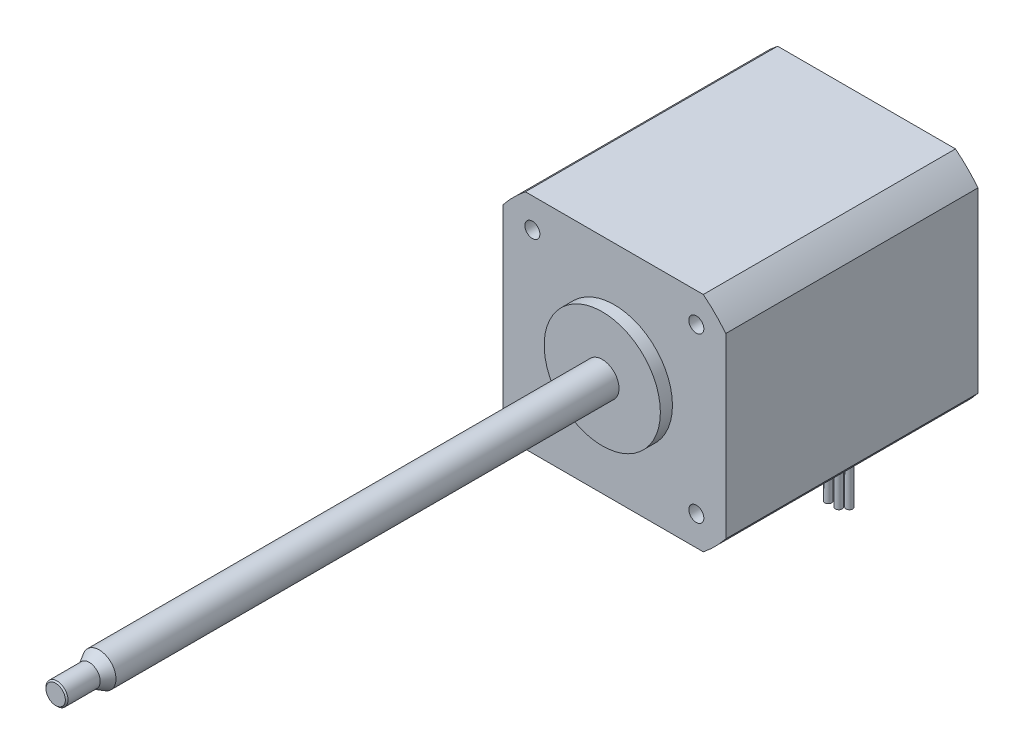
ISO-10303-21;
HEADER;
FILE_DESCRIPTION(('STEP AP214'),'2;1');
FILE_NAME('part.step','',(''),(''),'','','');
FILE_SCHEMA(('AUTOMOTIVE_DESIGN { 1 0 10303 214 1 1 1 1 }'));
ENDSEC;
DATA;
#1=APPLICATION_CONTEXT('core data for automotive mechanical design processes');
#2=APPLICATION_PROTOCOL_DEFINITION('international standard','automotive_design',2000,#1);
#3=PRODUCT_CONTEXT('',#1,'mechanical');
#4=PRODUCT('Part','Part','',(#3));
#5=PRODUCT_RELATED_PRODUCT_CATEGORY('part','',(#4));
#6=PRODUCT_DEFINITION_FORMATION('','',#4);
#7=PRODUCT_DEFINITION_CONTEXT('part definition',#1,'design');
#8=PRODUCT_DEFINITION('design','',#6,#7);
#9=PRODUCT_DEFINITION_SHAPE('','',#8);
#10=(LENGTH_UNIT() NAMED_UNIT(*) SI_UNIT(.MILLI.,.METRE.));
#11=(NAMED_UNIT(*) PLANE_ANGLE_UNIT() SI_UNIT($,.RADIAN.));
#12=(NAMED_UNIT(*) SI_UNIT($,.STERADIAN.) SOLID_ANGLE_UNIT());
#13=UNCERTAINTY_MEASURE_WITH_UNIT(LENGTH_MEASURE(1.E-05),#10,'distance_accuracy_value','');
#14=(GEOMETRIC_REPRESENTATION_CONTEXT(3) GLOBAL_UNCERTAINTY_ASSIGNED_CONTEXT((#13)) GLOBAL_UNIT_ASSIGNED_CONTEXT((#10,
#11,#12)) REPRESENTATION_CONTEXT('',''));
#15=CARTESIAN_POINT('',(0.,0.,0.));
#16=DIRECTION('',(0.,0.,1.));
#17=DIRECTION('',(1.,0.,0.));
#18=AXIS2_PLACEMENT_3D('',#15,#16,#17);
#19=CARTESIAN_POINT('',(0.,0.,105.524017134292));
#20=DIRECTION('',(0.,0.,-1.));
#21=DIRECTION('',(-0.896276816765099,0.443495059419404,0.));
#22=AXIS2_PLACEMENT_3D('',#19,#20,#21);
#23=CONICAL_SURFACE('',#22,2.0828,0.785398163397428);
#24=CARTESIAN_POINT('',(0.,0.,105.774017134292));
#25=DIRECTION('',(0.,0.,-1.));
#26=DIRECTION('',(-0.896276816765099,0.443495059419404,0.));
#27=AXIS2_PLACEMENT_3D('',#24,#25,#26);
#28=CIRCLE('',#27,1.8328);
#29=CARTESIAN_POINT('',(-1.64269614976707,0.812837744903882,105.774017134292));
#30=VERTEX_POINT('',#29);
#31=EDGE_CURVE('E300',#30,#30,#28,.T.);
#32=ORIENTED_EDGE('',*,*,#31,.T.);
#33=EDGE_LOOP('',(#32));
#34=FACE_BOUND('',#33,.T.);
#35=CARTESIAN_POINT('',(0.,0.,105.524017134292));
#36=DIRECTION('',(0.,0.,-1.));
#37=DIRECTION('',(-0.896276816765099,0.443495059419404,0.));
#38=AXIS2_PLACEMENT_3D('',#35,#36,#37);
#39=CIRCLE('',#38,2.0828);
#40=CARTESIAN_POINT('',(-1.86676535395835,0.923711509758735,105.524017134292));
#41=VERTEX_POINT('',#40);
#42=EDGE_CURVE('E25',#41,#41,#39,.T.);
#43=ORIENTED_EDGE('',*,*,#42,.F.);
#44=EDGE_LOOP('',(#43));
#45=FACE_BOUND('',#44,.T.);
#46=ADVANCED_FACE('F16',(#34,#45),#23,.T.);
#47=CARTESIAN_POINT('',(0.,0.,105.774017134292));
#48=DIRECTION('',(0.,0.,-1.));
#49=DIRECTION('',(-0.896276816765099,0.443495059419404,0.));
#50=AXIS2_PLACEMENT_3D('',#47,#48,#49);
#51=CYLINDRICAL_SURFACE('',#50,2.0828);
#52=ORIENTED_EDGE('',*,*,#42,.T.);
#53=EDGE_LOOP('',(#52));
#54=FACE_BOUND('',#53,.T.);
#55=CARTESIAN_POINT('',(0.,0.,99.4240171342925));
#56=DIRECTION('',(0.,0.,-1.));
#57=DIRECTION('',(-0.896276816765099,0.443495059419404,0.));
#58=AXIS2_PLACEMENT_3D('',#55,#56,#57);
#59=CIRCLE('',#58,2.0828);
#60=CARTESIAN_POINT('',(-1.86676535395835,0.923711509758736,99.4240171342925));
#61=VERTEX_POINT('',#60);
#62=EDGE_CURVE('E316',#61,#61,#59,.T.);
#63=ORIENTED_EDGE('',*,*,#62,.F.);
#64=EDGE_LOOP('',(#63));
#65=FACE_BOUND('',#64,.T.);
#66=ADVANCED_FACE('F326',(#54,#65),#51,.T.);
#67=CARTESIAN_POINT('',(0.,0.,97.5322712422657));
#68=DIRECTION('',(0.,0.,-1.));
#69=DIRECTION('',(-0.896276816765099,0.443495059419404,0.));
#70=AXIS2_PLACEMENT_3D('',#67,#68,#69);
#71=CONICAL_SURFACE('',#70,3.175,0.523598775598295);
#72=ORIENTED_EDGE('',*,*,#62,.T.);
#73=EDGE_LOOP('',(#72));
#74=FACE_BOUND('',#73,.T.);
#75=CARTESIAN_POINT('',(0.,0.,97.5322712422657));
#76=DIRECTION('',(0.,0.,-1.));
#77=DIRECTION('',(-0.896276816765099,0.443495059419404,0.));
#78=AXIS2_PLACEMENT_3D('',#75,#76,#77);
#79=CIRCLE('',#78,3.175);
#80=CARTESIAN_POINT('',(-2.84567889322919,1.40809681365661,97.5322712422657));
#81=VERTEX_POINT('',#80);
#82=EDGE_CURVE('E312',#81,#81,#79,.T.);
#83=ORIENTED_EDGE('',*,*,#82,.F.);
#84=EDGE_LOOP('',(#83));
#85=FACE_BOUND('',#84,.T.);
#86=ADVANCED_FACE('F334',(#74,#85),#71,.T.);
#87=CARTESIAN_POINT('',(0.,0.,105.774017134292));
#88=DIRECTION('',(0.,0.,-1.));
#89=DIRECTION('',(-0.896276816765099,0.443495059419404,0.));
#90=AXIS2_PLACEMENT_3D('',#87,#88,#89);
#91=CYLINDRICAL_SURFACE('',#90,3.17500000000001);
#92=CARTESIAN_POINT('',(0.,0.,2.286));
#93=DIRECTION('',(0.,0.,1.));
#94=DIRECTION('',(1.,0.,0.));
#95=AXIS2_PLACEMENT_3D('',#92,#93,#94);
#96=CIRCLE('',#95,3.17500000000001);
#97=CARTESIAN_POINT('',(3.175,0.,2.286));
#98=VERTEX_POINT('',#97);
#99=EDGE_CURVE('E11',#98,#98,#96,.F.);
#100=ORIENTED_EDGE('',*,*,#99,.F.);
#101=EDGE_LOOP('',(#100));
#102=FACE_BOUND('',#101,.T.);
#103=ORIENTED_EDGE('',*,*,#82,.T.);
#104=EDGE_LOOP('',(#103));
#105=FACE_BOUND('',#104,.T.);
#106=ADVANCED_FACE('F339',(#102,#105),#91,.T.);
#107=CARTESIAN_POINT('',(1.64269614976707,-0.812837744903882,105.774017134292));
#108=DIRECTION('',(0.,0.,1.));
#109=DIRECTION('',(0.896276816765099,-0.443495059419404,0.));
#110=AXIS2_PLACEMENT_3D('',#107,#108,#109);
#111=PLANE('',#110);
#112=ORIENTED_EDGE('',*,*,#31,.F.);
#113=EDGE_LOOP('',(#112));
#114=FACE_BOUND('',#113,.T.);
#115=ADVANCED_FACE('F337',(#114),#111,.T.);
#116=CARTESIAN_POINT('',(-2.25,-17.925,-40.75));
#117=DIRECTION('',(0.,1.,0.));
#118=DIRECTION('',(0.,0.,1.));
#119=AXIS2_PLACEMENT_3D('',#116,#117,#118);
#120=PLANE('',#119);
#121=DIRECTION('',(0.,0.,-1.));
#122=VECTOR('',#121,1.);
#123=CARTESIAN_POINT('',(-2.25,-17.925,-44.25));
#124=LINE('',#123,#122);
#125=CARTESIAN_POINT('',(-2.25,-17.925,-40.75));
#126=VERTEX_POINT('',#125);
#127=CARTESIAN_POINT('',(-2.25,-17.925,-44.25));
#128=VERTEX_POINT('',#127);
#129=EDGE_CURVE('E136',#126,#128,#124,.T.);
#130=ORIENTED_EDGE('',*,*,#129,.T.);
#131=DIRECTION('',(1.,0.,0.));
#132=VECTOR('',#131,1.);
#133=CARTESIAN_POINT('',(-2.25,-17.925,-44.25));
#134=LINE('',#133,#132);
#135=CARTESIAN_POINT('',(2.25,-17.925,-44.25));
#136=VERTEX_POINT('',#135);
#137=EDGE_CURVE('E146',#128,#136,#134,.T.);
#138=ORIENTED_EDGE('',*,*,#137,.T.);
#139=DIRECTION('',(0.,0.,1.));
#140=VECTOR('',#139,1.);
#141=CARTESIAN_POINT('',(2.25,-17.925,-44.25));
#142=LINE('',#141,#140);
#143=CARTESIAN_POINT('',(2.25,-17.925,-40.75));
#144=VERTEX_POINT('',#143);
#145=EDGE_CURVE('E152',#136,#144,#142,.T.);
#146=ORIENTED_EDGE('',*,*,#145,.T.);
#147=DIRECTION('',(-1.,0.,0.));
#148=VECTOR('',#147,1.);
#149=CARTESIAN_POINT('',(-2.25,-17.925,-40.75));
#150=LINE('',#149,#148);
#151=EDGE_CURVE('E143',#144,#126,#150,.T.);
#152=ORIENTED_EDGE('',*,*,#151,.T.);
#153=EDGE_LOOP('',(#130,#138,#146,#152));
#154=FACE_BOUND('',#153,.T.);
#155=CARTESIAN_POINT('',(-1.5,-17.925,-42.));
#156=DIRECTION('',(0.,1.,0.));
#157=DIRECTION('',(0.,0.,1.));
#158=AXIS2_PLACEMENT_3D('',#155,#156,#157);
#159=CIRCLE('',#158,0.634999999999999);
#160=CARTESIAN_POINT('',(-1.5,-17.925,-41.365));
#161=VERTEX_POINT('',#160);
#162=EDGE_CURVE('E284',#161,#161,#159,.F.);
#163=ORIENTED_EDGE('',*,*,#162,.F.);
#164=EDGE_LOOP('',(#163));
#165=FACE_BOUND('',#164,.T.);
#166=CARTESIAN_POINT('',(0.500000000000003,-17.925,-42.));
#167=DIRECTION('',(0.,1.,0.));
#168=DIRECTION('',(0.,0.,1.));
#169=AXIS2_PLACEMENT_3D('',#166,#167,#168);
#170=CIRCLE('',#169,0.634999999999999);
#171=CARTESIAN_POINT('',(0.500000000000003,-17.925,-41.365));
#172=VERTEX_POINT('',#171);
#173=EDGE_CURVE('E288',#172,#172,#170,.F.);
#174=ORIENTED_EDGE('',*,*,#173,.F.);
#175=EDGE_LOOP('',(#174));
#176=FACE_BOUND('',#175,.T.);
#177=CARTESIAN_POINT('',(-0.499999999999996,-17.925,-43.));
#178=DIRECTION('',(0.,1.,0.));
#179=DIRECTION('',(0.,0.,1.));
#180=AXIS2_PLACEMENT_3D('',#177,#178,#179);
#181=CIRCLE('',#180,0.634999999999998);
#182=CARTESIAN_POINT('',(-0.499999999999996,-17.925,-42.365));
#183=VERTEX_POINT('',#182);
#184=EDGE_CURVE('E292',#183,#183,#181,.F.);
#185=ORIENTED_EDGE('',*,*,#184,.F.);
#186=EDGE_LOOP('',(#185));
#187=FACE_BOUND('',#186,.T.);
#188=CARTESIAN_POINT('',(1.5,-17.925,-43.));
#189=DIRECTION('',(0.,1.,0.));
#190=DIRECTION('',(0.,0.,1.));
#191=AXIS2_PLACEMENT_3D('',#188,#189,#190);
#192=CIRCLE('',#191,0.634999999999998);
#193=CARTESIAN_POINT('',(1.5,-17.925,-42.365));
#194=VERTEX_POINT('',#193);
#195=EDGE_CURVE('E296',#194,#194,#192,.F.);
#196=ORIENTED_EDGE('',*,*,#195,.F.);
#197=EDGE_LOOP('',(#196));
#198=FACE_BOUND('',#197,.T.);
#199=ADVANCED_FACE('F154',(#154,#165,#176,#187,#198),#120,.F.);
#200=CARTESIAN_POINT('',(-21.1,-21.1,0.));
#201=DIRECTION('',(0.,0.,1.));
#202=DIRECTION('',(1.,0.,0.));
#203=AXIS2_PLACEMENT_3D('',#200,#201,#202);
#204=PLANE('',#203);
#205=CARTESIAN_POINT('',(-15.52,-15.52,0.));
#206=DIRECTION('',(0.,0.,1.));
#207=DIRECTION('',(1.,0.,0.));
#208=AXIS2_PLACEMENT_3D('',#205,#206,#207);
#209=CIRCLE('',#208,1.4224);
#210=CARTESIAN_POINT('',(-14.0976,-15.52,0.));
#211=VERTEX_POINT('',#210);
#212=EDGE_CURVE('E964',#211,#211,#209,.T.);
#213=ORIENTED_EDGE('',*,*,#212,.F.);
#214=EDGE_LOOP('',(#213));
#215=FACE_BOUND('',#214,.T.);
#216=CARTESIAN_POINT('',(15.52,-15.52,0.));
#217=DIRECTION('',(0.,0.,1.));
#218=DIRECTION('',(1.,0.,0.));
#219=AXIS2_PLACEMENT_3D('',#216,#217,#218);
#220=CIRCLE('',#219,1.4224);
#221=CARTESIAN_POINT('',(16.9424,-15.52,0.));
#222=VERTEX_POINT('',#221);
#223=EDGE_CURVE('E824',#222,#222,#220,.T.);
#224=ORIENTED_EDGE('',*,*,#223,.F.);
#225=EDGE_LOOP('',(#224));
#226=FACE_BOUND('',#225,.T.);
#227=CARTESIAN_POINT('',(15.52,15.52,0.));
#228=DIRECTION('',(0.,0.,1.));
#229=DIRECTION('',(1.,0.,0.));
#230=AXIS2_PLACEMENT_3D('',#227,#228,#229);
#231=CIRCLE('',#230,1.4224);
#232=CARTESIAN_POINT('',(16.9424,15.52,0.));
#233=VERTEX_POINT('',#232);
#234=EDGE_CURVE('E767',#233,#233,#231,.T.);
#235=ORIENTED_EDGE('',*,*,#234,.F.);
#236=EDGE_LOOP('',(#235));
#237=FACE_BOUND('',#236,.T.);
#238=CARTESIAN_POINT('',(-15.52,15.52,0.));
#239=DIRECTION('',(0.,0.,1.));
#240=DIRECTION('',(1.,0.,0.));
#241=AXIS2_PLACEMENT_3D('',#238,#239,#240);
#242=CIRCLE('',#241,1.4224);
#243=CARTESIAN_POINT('',(-14.0976,15.52,0.));
#244=VERTEX_POINT('',#243);
#245=EDGE_CURVE('E756',#244,#244,#242,.T.);
#246=ORIENTED_EDGE('',*,*,#245,.F.);
#247=EDGE_LOOP('',(#246));
#248=FACE_BOUND('',#247,.T.);
#249=CARTESIAN_POINT('',(-0.113980167868195,-0.113980167868181,0.));
#250=DIRECTION('',(0.,0.,-1.));
#251=DIRECTION('',(-1.,0.,0.));
#252=AXIS2_PLACEMENT_3D('',#249,#250,#251);
#253=CIRCLE('',#252,26.8351);
#254=CARTESIAN_POINT('',(-16.8385,-21.1,0.));
#255=VERTEX_POINT('',#254);
#256=CARTESIAN_POINT('',(-21.1,-16.8385,0.));
#257=VERTEX_POINT('',#256);
#258=EDGE_CURVE('E199',#255,#257,#253,.T.);
#259=ORIENTED_EDGE('',*,*,#258,.F.);
#260=DIRECTION('',(1.,0.,0.));
#261=VECTOR('',#260,1.);
#262=CARTESIAN_POINT('',(-21.1,-21.1,0.));
#263=LINE('',#262,#261);
#264=CARTESIAN_POINT('',(16.8385,-21.1,0.));
#265=VERTEX_POINT('',#264);
#266=EDGE_CURVE('E260',#255,#265,#263,.T.);
#267=ORIENTED_EDGE('',*,*,#266,.T.);
#268=CARTESIAN_POINT('',(0.113980167868195,-0.113980167868181,0.));
#269=DIRECTION('',(0.,0.,-1.));
#270=DIRECTION('',(1.,0.,0.));
#271=AXIS2_PLACEMENT_3D('',#268,#269,#270);
#272=CIRCLE('',#271,26.8351);
#273=CARTESIAN_POINT('',(21.1,-16.8385,0.));
#274=VERTEX_POINT('',#273);
#275=EDGE_CURVE('E209',#274,#265,#272,.T.);
#276=ORIENTED_EDGE('',*,*,#275,.F.);
#277=DIRECTION('',(0.,1.,0.));
#278=VECTOR('',#277,1.);
#279=CARTESIAN_POINT('',(21.1,21.1,0.));
#280=LINE('',#279,#278);
#281=CARTESIAN_POINT('',(21.1,16.8385,0.));
#282=VERTEX_POINT('',#281);
#283=EDGE_CURVE('E263',#274,#282,#280,.T.);
#284=ORIENTED_EDGE('',*,*,#283,.T.);
#285=CARTESIAN_POINT('',(0.113980167868195,0.113980167868181,0.));
#286=DIRECTION('',(0.,0.,-1.));
#287=DIRECTION('',(-1.,0.,0.));
#288=AXIS2_PLACEMENT_3D('',#285,#286,#287);
#289=CIRCLE('',#288,26.8351);
#290=CARTESIAN_POINT('',(16.8385,21.1,0.));
#291=VERTEX_POINT('',#290);
#292=EDGE_CURVE('E238',#291,#282,#289,.T.);
#293=ORIENTED_EDGE('',*,*,#292,.F.);
#294=DIRECTION('',(-1.,0.,0.));
#295=VECTOR('',#294,1.);
#296=CARTESIAN_POINT('',(-21.1,21.1,0.));
#297=LINE('',#296,#295);
#298=CARTESIAN_POINT('',(-16.8385,21.1,0.));
#299=VERTEX_POINT('',#298);
#300=EDGE_CURVE('E266',#291,#299,#297,.T.);
#301=ORIENTED_EDGE('',*,*,#300,.T.);
#302=CARTESIAN_POINT('',(-0.113980167868195,0.113980167868181,0.));
#303=DIRECTION('',(0.,0.,-1.));
#304=DIRECTION('',(1.,0.,0.));
#305=AXIS2_PLACEMENT_3D('',#302,#303,#304);
#306=CIRCLE('',#305,26.8351);
#307=CARTESIAN_POINT('',(-21.1,16.8385,0.));
#308=VERTEX_POINT('',#307);
#309=EDGE_CURVE('E224',#308,#299,#306,.T.);
#310=ORIENTED_EDGE('',*,*,#309,.F.);
#311=DIRECTION('',(0.,-1.,0.));
#312=VECTOR('',#311,1.);
#313=CARTESIAN_POINT('',(-21.1,21.1,0.));
#314=LINE('',#313,#312);
#315=EDGE_CURVE('E254',#308,#257,#314,.T.);
#316=ORIENTED_EDGE('',*,*,#315,.T.);
#317=EDGE_LOOP('',(#259,#267,#276,#284,#293,#301,#310,#316));
#318=FACE_BOUND('',#317,.T.);
#319=CARTESIAN_POINT('',(0.,0.,0.));
#320=DIRECTION('',(0.,0.,1.));
#321=DIRECTION('',(1.,0.,0.));
#322=AXIS2_PLACEMENT_3D('',#319,#320,#321);
#323=CIRCLE('',#322,10.9982);
#324=CARTESIAN_POINT('',(10.9982,0.,0.));
#325=VERTEX_POINT('',#324);
#326=EDGE_CURVE('E186',#325,#325,#323,.T.);
#327=ORIENTED_EDGE('',*,*,#326,.F.);
#328=EDGE_LOOP('',(#327));
#329=FACE_BOUND('',#328,.T.);
#330=ADVANCED_FACE('F344',(#215,#226,#237,#248,#318,#329),#204,.T.);
#331=CARTESIAN_POINT('',(-21.1,21.1,-47.75));
#332=DIRECTION('',(-1.,0.,0.));
#333=DIRECTION('',(0.,-1.,0.));
#334=AXIS2_PLACEMENT_3D('',#331,#332,#333);
#335=PLANE('',#334);
#336=DIRECTION('',(0.,0.,1.));
#337=VECTOR('',#336,1.);
#338=CARTESIAN_POINT('',(-21.1,-16.8385,-47.75));
#339=LINE('',#338,#337);
#340=CARTESIAN_POINT('',(-21.1,-16.8385,-47.75));
#341=VERTEX_POINT('',#340);
#342=EDGE_CURVE('E206',#341,#257,#339,.T.);
#343=ORIENTED_EDGE('',*,*,#342,.T.);
#344=ORIENTED_EDGE('',*,*,#315,.F.);
#345=DIRECTION('',(0.,0.,1.));
#346=VECTOR('',#345,1.);
#347=CARTESIAN_POINT('',(-21.1,16.8385,-47.75));
#348=LINE('',#347,#346);
#349=CARTESIAN_POINT('',(-21.1,16.8385,-47.75));
#350=VERTEX_POINT('',#349);
#351=EDGE_CURVE('E235',#350,#308,#348,.T.);
#352=ORIENTED_EDGE('',*,*,#351,.F.);
#353=DIRECTION('',(0.,-1.,0.));
#354=VECTOR('',#353,1.);
#355=CARTESIAN_POINT('',(-21.1,21.1,-47.75));
#356=LINE('',#355,#354);
#357=EDGE_CURVE('E270',#350,#341,#356,.T.);
#358=ORIENTED_EDGE('',*,*,#357,.T.);
#359=EDGE_LOOP('',(#343,#344,#352,#358));
#360=FACE_BOUND('',#359,.T.);
#361=ADVANCED_FACE('F351',(#360),#335,.T.);
#362=CARTESIAN_POINT('',(-21.1,21.1,-47.75));
#363=DIRECTION('',(0.,1.,0.));
#364=DIRECTION('',(0.,0.,1.));
#365=AXIS2_PLACEMENT_3D('',#362,#363,#364);
#366=PLANE('',#365);
#367=DIRECTION('',(0.,0.,1.));
#368=VECTOR('',#367,1.);
#369=CARTESIAN_POINT('',(-16.8385,21.1,-47.75));
#370=LINE('',#369,#368);
#371=CARTESIAN_POINT('',(-16.8385,21.1,-47.75));
#372=VERTEX_POINT('',#371);
#373=EDGE_CURVE('E234',#372,#299,#370,.T.);
#374=ORIENTED_EDGE('',*,*,#373,.T.);
#375=ORIENTED_EDGE('',*,*,#300,.F.);
#376=DIRECTION('',(0.,0.,1.));
#377=VECTOR('',#376,1.);
#378=CARTESIAN_POINT('',(16.8385,21.1,-47.75));
#379=LINE('',#378,#377);
#380=CARTESIAN_POINT('',(16.8385,21.1,-47.75));
#381=VERTEX_POINT('',#380);
#382=EDGE_CURVE('E249',#381,#291,#379,.T.);
#383=ORIENTED_EDGE('',*,*,#382,.F.);
#384=DIRECTION('',(-1.,0.,0.));
#385=VECTOR('',#384,1.);
#386=CARTESIAN_POINT('',(-21.1,21.1,-47.75));
#387=LINE('',#386,#385);
#388=EDGE_CURVE('E280',#381,#372,#387,.T.);
#389=ORIENTED_EDGE('',*,*,#388,.T.);
#390=EDGE_LOOP('',(#374,#375,#383,#389));
#391=FACE_BOUND('',#390,.T.);
#392=ADVANCED_FACE('F492',(#391),#366,.T.);
#393=CARTESIAN_POINT('',(21.1,21.1,-47.75));
#394=DIRECTION('',(1.,0.,0.));
#395=DIRECTION('',(0.,1.,0.));
#396=AXIS2_PLACEMENT_3D('',#393,#394,#395);
#397=PLANE('',#396);
#398=DIRECTION('',(0.,0.,1.));
#399=VECTOR('',#398,1.);
#400=CARTESIAN_POINT('',(21.1,-16.8385,-47.75));
#401=LINE('',#400,#399);
#402=CARTESIAN_POINT('',(21.1,-16.8385,-47.75));
#403=VERTEX_POINT('',#402);
#404=EDGE_CURVE('E221',#403,#274,#401,.T.);
#405=ORIENTED_EDGE('',*,*,#404,.F.);
#406=DIRECTION('',(0.,1.,0.));
#407=VECTOR('',#406,1.);
#408=CARTESIAN_POINT('',(21.1,21.1,-47.75));
#409=LINE('',#408,#407);
#410=CARTESIAN_POINT('',(21.1,16.8385,-47.75));
#411=VERTEX_POINT('',#410);
#412=EDGE_CURVE('E277',#403,#411,#409,.T.);
#413=ORIENTED_EDGE('',*,*,#412,.T.);
#414=DIRECTION('',(0.,0.,1.));
#415=VECTOR('',#414,1.);
#416=CARTESIAN_POINT('',(21.1,16.8385,-47.75));
#417=LINE('',#416,#415);
#418=EDGE_CURVE('E250',#411,#282,#417,.T.);
#419=ORIENTED_EDGE('',*,*,#418,.T.);
#420=ORIENTED_EDGE('',*,*,#283,.F.);
#421=EDGE_LOOP('',(#405,#413,#419,#420));
#422=FACE_BOUND('',#421,.T.);
#423=ADVANCED_FACE('F486',(#422),#397,.T.);
#424=CARTESIAN_POINT('',(-21.1,-21.1,-47.75));
#425=DIRECTION('',(0.,-1.,0.));
#426=DIRECTION('',(0.,0.,-1.));
#427=AXIS2_PLACEMENT_3D('',#424,#425,#426);
#428=PLANE('',#427);
#429=DIRECTION('',(0.,0.,-1.));
#430=VECTOR('',#429,1.);
#431=CARTESIAN_POINT('',(-2.25,-21.1,-44.25));
#432=LINE('',#431,#430);
#433=CARTESIAN_POINT('',(-2.25,-21.1,-40.75));
#434=VERTEX_POINT('',#433);
#435=CARTESIAN_POINT('',(-2.25,-21.1,-44.25));
#436=VERTEX_POINT('',#435);
#437=EDGE_CURVE('E37',#434,#436,#432,.T.);
#438=ORIENTED_EDGE('',*,*,#437,.F.);
#439=DIRECTION('',(-1.,0.,0.));
#440=VECTOR('',#439,1.);
#441=CARTESIAN_POINT('',(-2.25,-21.1,-40.75));
#442=LINE('',#441,#440);
#443=CARTESIAN_POINT('',(2.25,-21.1,-40.75));
#444=VERTEX_POINT('',#443);
#445=EDGE_CURVE('E158',#444,#434,#442,.T.);
#446=ORIENTED_EDGE('',*,*,#445,.F.);
#447=DIRECTION('',(0.,0.,1.));
#448=VECTOR('',#447,1.);
#449=CARTESIAN_POINT('',(2.25,-21.1,-44.25));
#450=LINE('',#449,#448);
#451=CARTESIAN_POINT('',(2.25,-21.1,-44.25));
#452=VERTEX_POINT('',#451);
#453=EDGE_CURVE('E165',#452,#444,#450,.T.);
#454=ORIENTED_EDGE('',*,*,#453,.F.);
#455=DIRECTION('',(1.,0.,0.));
#456=VECTOR('',#455,1.);
#457=CARTESIAN_POINT('',(-2.25,-21.1,-44.25));
#458=LINE('',#457,#456);
#459=EDGE_CURVE('E177',#436,#452,#458,.T.);
#460=ORIENTED_EDGE('',*,*,#459,.F.);
#461=EDGE_LOOP('',(#438,#446,#454,#460));
#462=FACE_BOUND('',#461,.T.);
#463=DIRECTION('',(0.,0.,1.));
#464=VECTOR('',#463,1.);
#465=CARTESIAN_POINT('',(-16.8385,-21.1,-47.75));
#466=LINE('',#465,#464);
#467=CARTESIAN_POINT('',(-16.8385,-21.1,-47.75));
#468=VERTEX_POINT('',#467);
#469=EDGE_CURVE('E47',#468,#255,#466,.T.);
#470=ORIENTED_EDGE('',*,*,#469,.F.);
#471=DIRECTION('',(1.,0.,0.));
#472=VECTOR('',#471,1.);
#473=CARTESIAN_POINT('',(-21.1,-21.1,-47.75));
#474=LINE('',#473,#472);
#475=CARTESIAN_POINT('',(16.8385,-21.1,-47.75));
#476=VERTEX_POINT('',#475);
#477=EDGE_CURVE('E274',#468,#476,#474,.T.);
#478=ORIENTED_EDGE('',*,*,#477,.T.);
#479=DIRECTION('',(0.,0.,1.));
#480=VECTOR('',#479,1.);
#481=CARTESIAN_POINT('',(16.8385,-21.1,-47.75));
#482=LINE('',#481,#480);
#483=EDGE_CURVE('E220',#476,#265,#482,.T.);
#484=ORIENTED_EDGE('',*,*,#483,.T.);
#485=ORIENTED_EDGE('',*,*,#266,.F.);
#486=EDGE_LOOP('',(#470,#478,#484,#485));
#487=FACE_BOUND('',#486,.T.);
#488=ADVANCED_FACE('F491',(#462,#487),#428,.T.);
#489=CARTESIAN_POINT('',(-21.1,-21.1,-47.75));
#490=DIRECTION('',(0.,0.,1.));
#491=DIRECTION('',(1.,0.,0.));
#492=AXIS2_PLACEMENT_3D('',#489,#490,#491);
#493=PLANE('',#492);
#494=CARTESIAN_POINT('',(0.,0.,-47.75));
#495=DIRECTION('',(0.,0.,1.));
#496=DIRECTION('',(1.,0.,0.));
#497=AXIS2_PLACEMENT_3D('',#494,#495,#496);
#498=CIRCLE('',#497,3.17500000000001);
#499=CARTESIAN_POINT('',(3.175,0.,-47.75));
#500=VERTEX_POINT('',#499);
#501=EDGE_CURVE('E19',#500,#500,#498,.F.);
#502=ORIENTED_EDGE('',*,*,#501,.F.);
#503=EDGE_LOOP('',(#502));
#504=FACE_BOUND('',#503,.T.);
#505=ORIENTED_EDGE('',*,*,#477,.F.);
#506=CARTESIAN_POINT('',(-0.113980167868195,-0.113980167868181,-47.75));
#507=DIRECTION('',(0.,0.,-1.));
#508=DIRECTION('',(-1.,0.,0.));
#509=AXIS2_PLACEMENT_3D('',#506,#507,#508);
#510=CIRCLE('',#509,26.8351);
#511=EDGE_CURVE('E202',#468,#341,#510,.T.);
#512=ORIENTED_EDGE('',*,*,#511,.T.);
#513=ORIENTED_EDGE('',*,*,#357,.F.);
#514=CARTESIAN_POINT('',(-0.113980167868195,0.113980167868181,-47.75));
#515=DIRECTION('',(0.,0.,-1.));
#516=DIRECTION('',(1.,0.,0.));
#517=AXIS2_PLACEMENT_3D('',#514,#515,#516);
#518=CIRCLE('',#517,26.8351);
#519=EDGE_CURVE('E230',#350,#372,#518,.T.);
#520=ORIENTED_EDGE('',*,*,#519,.T.);
#521=ORIENTED_EDGE('',*,*,#388,.F.);
#522=CARTESIAN_POINT('',(0.113980167868195,0.113980167868181,-47.75));
#523=DIRECTION('',(0.,0.,-1.));
#524=DIRECTION('',(-1.,0.,0.));
#525=AXIS2_PLACEMENT_3D('',#522,#523,#524);
#526=CIRCLE('',#525,26.8351);
#527=EDGE_CURVE('E245',#381,#411,#526,.T.);
#528=ORIENTED_EDGE('',*,*,#527,.T.);
#529=ORIENTED_EDGE('',*,*,#412,.F.);
#530=CARTESIAN_POINT('',(0.113980167868195,-0.113980167868181,-47.75));
#531=DIRECTION('',(0.,0.,-1.));
#532=DIRECTION('',(1.,0.,0.));
#533=AXIS2_PLACEMENT_3D('',#530,#531,#532);
#534=CIRCLE('',#533,26.8351);
#535=EDGE_CURVE('E216',#403,#476,#534,.T.);
#536=ORIENTED_EDGE('',*,*,#535,.T.);
#537=EDGE_LOOP('',(#505,#512,#513,#520,#521,#528,#529,#536));
#538=FACE_BOUND('',#537,.T.);
#539=ADVANCED_FACE('F612',(#504,#538),#493,.F.);
#540=CARTESIAN_POINT('',(0.113980167868195,0.113980167868181,-47.75));
#541=DIRECTION('',(0.,0.,1.));
#542=DIRECTION('',(1.,0.,0.));
#543=AXIS2_PLACEMENT_3D('',#540,#541,#542);
#544=CYLINDRICAL_SURFACE('',#543,26.8351);
#545=ORIENTED_EDGE('',*,*,#292,.T.);
#546=ORIENTED_EDGE('',*,*,#418,.F.);
#547=ORIENTED_EDGE('',*,*,#527,.F.);
#548=ORIENTED_EDGE('',*,*,#382,.T.);
#549=EDGE_LOOP('',(#545,#546,#547,#548));
#550=FACE_BOUND('',#549,.T.);
#551=ADVANCED_FACE('F619',(#550),#544,.T.);
#552=CARTESIAN_POINT('',(-0.113980167868195,0.113980167868181,-47.75));
#553=DIRECTION('',(0.,0.,1.));
#554=DIRECTION('',(1.,0.,0.));
#555=AXIS2_PLACEMENT_3D('',#552,#553,#554);
#556=CYLINDRICAL_SURFACE('',#555,26.8351);
#557=ORIENTED_EDGE('',*,*,#309,.T.);
#558=ORIENTED_EDGE('',*,*,#373,.F.);
#559=ORIENTED_EDGE('',*,*,#519,.F.);
#560=ORIENTED_EDGE('',*,*,#351,.T.);
#561=EDGE_LOOP('',(#557,#558,#559,#560));
#562=FACE_BOUND('',#561,.T.);
#563=ADVANCED_FACE('F624',(#562),#556,.T.);
#564=CARTESIAN_POINT('',(0.113980167868195,-0.113980167868181,-47.75));
#565=DIRECTION('',(0.,0.,1.));
#566=DIRECTION('',(1.,0.,0.));
#567=AXIS2_PLACEMENT_3D('',#564,#565,#566);
#568=CYLINDRICAL_SURFACE('',#567,26.8351);
#569=ORIENTED_EDGE('',*,*,#275,.T.);
#570=ORIENTED_EDGE('',*,*,#483,.F.);
#571=ORIENTED_EDGE('',*,*,#535,.F.);
#572=ORIENTED_EDGE('',*,*,#404,.T.);
#573=EDGE_LOOP('',(#569,#570,#571,#572));
#574=FACE_BOUND('',#573,.T.);
#575=ADVANCED_FACE('F630',(#574),#568,.T.);
#576=CARTESIAN_POINT('',(-0.113980167868195,-0.113980167868181,-47.75));
#577=DIRECTION('',(0.,0.,1.));
#578=DIRECTION('',(1.,0.,0.));
#579=AXIS2_PLACEMENT_3D('',#576,#577,#578);
#580=CYLINDRICAL_SURFACE('',#579,26.8351);
#581=ORIENTED_EDGE('',*,*,#258,.T.);
#582=ORIENTED_EDGE('',*,*,#342,.F.);
#583=ORIENTED_EDGE('',*,*,#511,.F.);
#584=ORIENTED_EDGE('',*,*,#469,.T.);
#585=EDGE_LOOP('',(#581,#582,#583,#584));
#586=FACE_BOUND('',#585,.T.);
#587=ADVANCED_FACE('F636',(#586),#580,.T.);
#588=CARTESIAN_POINT('',(0.,0.,2.286));
#589=DIRECTION('',(0.,0.,1.));
#590=DIRECTION('',(1.,0.,0.));
#591=AXIS2_PLACEMENT_3D('',#588,#589,#590);
#592=PLANE('',#591);
#593=ORIENTED_EDGE('',*,*,#99,.T.);
#594=EDGE_LOOP('',(#593));
#595=FACE_BOUND('',#594,.T.);
#596=CARTESIAN_POINT('',(0.,0.,2.286));
#597=DIRECTION('',(0.,0.,1.));
#598=DIRECTION('',(1.,0.,0.));
#599=AXIS2_PLACEMENT_3D('',#596,#597,#598);
#600=CIRCLE('',#599,10.9982);
#601=CARTESIAN_POINT('',(10.9982,0.,2.286));
#602=VERTEX_POINT('',#601);
#603=EDGE_CURVE('E195',#602,#602,#600,.T.);
#604=ORIENTED_EDGE('',*,*,#603,.T.);
#605=EDGE_LOOP('',(#604));
#606=FACE_BOUND('',#605,.T.);
#607=ADVANCED_FACE('F528',(#595,#606),#592,.T.);
#608=CARTESIAN_POINT('',(0.,0.,2.286));
#609=DIRECTION('',(0.,0.,-1.));
#610=DIRECTION('',(-1.,0.,0.));
#611=AXIS2_PLACEMENT_3D('',#608,#609,#610);
#612=CYLINDRICAL_SURFACE('',#611,10.9982);
#613=ORIENTED_EDGE('',*,*,#603,.F.);
#614=EDGE_LOOP('',(#613));
#615=FACE_BOUND('',#614,.T.);
#616=ORIENTED_EDGE('',*,*,#326,.T.);
#617=EDGE_LOOP('',(#616));
#618=FACE_BOUND('',#617,.T.);
#619=ADVANCED_FACE('F503',(#615,#618),#612,.T.);
#620=CARTESIAN_POINT('',(-2.25,-17.925,-44.25));
#621=DIRECTION('',(-1.,0.,0.));
#622=DIRECTION('',(0.,0.,1.));
#623=AXIS2_PLACEMENT_3D('',#620,#621,#622);
#624=PLANE('',#623);
#625=ORIENTED_EDGE('',*,*,#437,.T.);
#626=DIRECTION('',(0.,-1.,0.));
#627=VECTOR('',#626,1.);
#628=CARTESIAN_POINT('',(-2.25,-17.925,-44.25));
#629=LINE('',#628,#627);
#630=EDGE_CURVE('E132',#128,#436,#629,.T.);
#631=ORIENTED_EDGE('',*,*,#630,.F.);
#632=ORIENTED_EDGE('',*,*,#129,.F.);
#633=DIRECTION('',(0.,-1.,0.));
#634=VECTOR('',#633,1.);
#635=CARTESIAN_POINT('',(-2.25,-17.925,-40.75));
#636=LINE('',#635,#634);
#637=EDGE_CURVE('E183',#126,#434,#636,.T.);
#638=ORIENTED_EDGE('',*,*,#637,.T.);
#639=EDGE_LOOP('',(#625,#631,#632,#638));
#640=FACE_BOUND('',#639,.T.);
#641=ADVANCED_FACE('F134',(#640),#624,.F.);
#642=CARTESIAN_POINT('',(-2.25,-17.925,-40.75));
#643=DIRECTION('',(0.,0.,1.));
#644=DIRECTION('',(1.,0.,0.));
#645=AXIS2_PLACEMENT_3D('',#642,#643,#644);
#646=PLANE('',#645);
#647=ORIENTED_EDGE('',*,*,#445,.T.);
#648=ORIENTED_EDGE('',*,*,#637,.F.);
#649=ORIENTED_EDGE('',*,*,#151,.F.);
#650=DIRECTION('',(0.,-1.,0.));
#651=VECTOR('',#650,1.);
#652=CARTESIAN_POINT('',(2.25,-17.925,-40.75));
#653=LINE('',#652,#651);
#654=EDGE_CURVE('E187',#144,#444,#653,.T.);
#655=ORIENTED_EDGE('',*,*,#654,.T.);
#656=EDGE_LOOP('',(#647,#648,#649,#655));
#657=FACE_BOUND('',#656,.T.);
#658=ADVANCED_FACE('F472',(#657),#646,.F.);
#659=CARTESIAN_POINT('',(2.25,-17.925,-44.25));
#660=DIRECTION('',(1.,0.,0.));
#661=DIRECTION('',(0.,0.,-1.));
#662=AXIS2_PLACEMENT_3D('',#659,#660,#661);
#663=PLANE('',#662);
#664=ORIENTED_EDGE('',*,*,#453,.T.);
#665=ORIENTED_EDGE('',*,*,#654,.F.);
#666=ORIENTED_EDGE('',*,*,#145,.F.);
#667=DIRECTION('',(0.,-1.,0.));
#668=VECTOR('',#667,1.);
#669=CARTESIAN_POINT('',(2.25,-17.925,-44.25));
#670=LINE('',#669,#668);
#671=EDGE_CURVE('E142',#136,#452,#670,.T.);
#672=ORIENTED_EDGE('',*,*,#671,.T.);
#673=EDGE_LOOP('',(#664,#665,#666,#672));
#674=FACE_BOUND('',#673,.T.);
#675=ADVANCED_FACE('F477',(#674),#663,.F.);
#676=CARTESIAN_POINT('',(-2.25,-17.925,-44.25));
#677=DIRECTION('',(0.,0.,-1.));
#678=DIRECTION('',(-1.,0.,0.));
#679=AXIS2_PLACEMENT_3D('',#676,#677,#678);
#680=PLANE('',#679);
#681=ORIENTED_EDGE('',*,*,#459,.T.);
#682=ORIENTED_EDGE('',*,*,#671,.F.);
#683=ORIENTED_EDGE('',*,*,#137,.F.);
#684=ORIENTED_EDGE('',*,*,#630,.T.);
#685=EDGE_LOOP('',(#681,#682,#683,#684));
#686=FACE_BOUND('',#685,.T.);
#687=ADVANCED_FACE('F147',(#686),#680,.F.);
#688=CARTESIAN_POINT('',(-1.5,-42.925,-42.));
#689=DIRECTION('',(0.,1.,0.));
#690=DIRECTION('',(0.,0.,1.));
#691=AXIS2_PLACEMENT_3D('',#688,#689,#690);
#692=CYLINDRICAL_SURFACE('',#691,0.634999999999999);
#693=CARTESIAN_POINT('',(-1.5,-42.925,-42.));
#694=DIRECTION('',(0.,-1.,0.));
#695=DIRECTION('',(0.,0.,-1.));
#696=AXIS2_PLACEMENT_3D('',#693,#694,#695);
#697=CIRCLE('',#696,0.634999999999999);
#698=CARTESIAN_POINT('',(-1.5,-42.925,-42.635));
#699=VERTEX_POINT('',#698);
#700=EDGE_CURVE('E168',#699,#699,#697,.T.);
#701=ORIENTED_EDGE('',*,*,#700,.F.);
#702=EDGE_LOOP('',(#701));
#703=FACE_BOUND('',#702,.T.);
#704=ORIENTED_EDGE('',*,*,#162,.T.);
#705=EDGE_LOOP('',(#704));
#706=FACE_BOUND('',#705,.T.);
#707=ADVANCED_FACE('F574',(#703,#706),#692,.T.);
#708=CARTESIAN_POINT('',(-1.5,-42.925,-42.));
#709=DIRECTION('',(0.,-1.,0.));
#710=DIRECTION('',(0.,0.,-1.));
#711=AXIS2_PLACEMENT_3D('',#708,#709,#710);
#712=PLANE('',#711);
#713=ORIENTED_EDGE('',*,*,#700,.T.);
#714=EDGE_LOOP('',(#713));
#715=FACE_BOUND('',#714,.T.);
#716=ADVANCED_FACE('F567',(#715),#712,.T.);
#717=CARTESIAN_POINT('',(0.500000000000003,-42.925,-42.));
#718=DIRECTION('',(0.,1.,0.));
#719=DIRECTION('',(0.,0.,1.));
#720=AXIS2_PLACEMENT_3D('',#717,#718,#719);
#721=CYLINDRICAL_SURFACE('',#720,0.634999999999999);
#722=CARTESIAN_POINT('',(0.500000000000003,-42.925,-42.));
#723=DIRECTION('',(0.,-1.,0.));
#724=DIRECTION('',(0.,0.,-1.));
#725=AXIS2_PLACEMENT_3D('',#722,#723,#724);
#726=CIRCLE('',#725,0.634999999999999);
#727=CARTESIAN_POINT('',(0.500000000000003,-42.925,-42.635));
#728=VERTEX_POINT('',#727);
#729=EDGE_CURVE('E777',#728,#728,#726,.T.);
#730=ORIENTED_EDGE('',*,*,#729,.F.);
#731=EDGE_LOOP('',(#730));
#732=FACE_BOUND('',#731,.T.);
#733=ORIENTED_EDGE('',*,*,#173,.T.);
#734=EDGE_LOOP('',(#733));
#735=FACE_BOUND('',#734,.T.);
#736=ADVANCED_FACE('F559',(#732,#735),#721,.T.);
#737=CARTESIAN_POINT('',(0.500000000000003,-42.925,-42.));
#738=DIRECTION('',(0.,-1.,0.));
#739=DIRECTION('',(0.,0.,-1.));
#740=AXIS2_PLACEMENT_3D('',#737,#738,#739);
#741=PLANE('',#740);
#742=ORIENTED_EDGE('',*,*,#729,.T.);
#743=EDGE_LOOP('',(#742));
#744=FACE_BOUND('',#743,.T.);
#745=ADVANCED_FACE('F551',(#744),#741,.T.);
#746=CARTESIAN_POINT('',(-0.499999999999996,-42.925,-43.));
#747=DIRECTION('',(0.,1.,0.));
#748=DIRECTION('',(0.,0.,1.));
#749=AXIS2_PLACEMENT_3D('',#746,#747,#748);
#750=CYLINDRICAL_SURFACE('',#749,0.634999999999998);
#751=CARTESIAN_POINT('',(-0.499999999999996,-42.925,-43.));
#752=DIRECTION('',(0.,-1.,0.));
#753=DIRECTION('',(0.,0.,-1.));
#754=AXIS2_PLACEMENT_3D('',#751,#752,#753);
#755=CIRCLE('',#754,0.634999999999998);
#756=CARTESIAN_POINT('',(-0.499999999999996,-42.925,-43.635));
#757=VERTEX_POINT('',#756);
#758=EDGE_CURVE('E774',#757,#757,#755,.T.);
#759=ORIENTED_EDGE('',*,*,#758,.F.);
#760=EDGE_LOOP('',(#759));
#761=FACE_BOUND('',#760,.T.);
#762=ORIENTED_EDGE('',*,*,#184,.T.);
#763=EDGE_LOOP('',(#762));
#764=FACE_BOUND('',#763,.T.);
#765=ADVANCED_FACE('F545',(#761,#764),#750,.T.);
#766=CARTESIAN_POINT('',(-0.499999999999996,-42.925,-43.));
#767=DIRECTION('',(0.,-1.,0.));
#768=DIRECTION('',(0.,0.,-1.));
#769=AXIS2_PLACEMENT_3D('',#766,#767,#768);
#770=PLANE('',#769);
#771=ORIENTED_EDGE('',*,*,#758,.T.);
#772=EDGE_LOOP('',(#771));
#773=FACE_BOUND('',#772,.T.);
#774=ADVANCED_FACE('F536',(#773),#770,.T.);
#775=CARTESIAN_POINT('',(1.5,-42.925,-43.));
#776=DIRECTION('',(0.,1.,0.));
#777=DIRECTION('',(0.,0.,1.));
#778=AXIS2_PLACEMENT_3D('',#775,#776,#777);
#779=CYLINDRICAL_SURFACE('',#778,0.634999999999998);
#780=CARTESIAN_POINT('',(1.5,-42.925,-43.));
#781=DIRECTION('',(0.,-1.,0.));
#782=DIRECTION('',(0.,0.,-1.));
#783=AXIS2_PLACEMENT_3D('',#780,#781,#782);
#784=CIRCLE('',#783,0.634999999999998);
#785=CARTESIAN_POINT('',(1.5,-42.925,-43.635));
#786=VERTEX_POINT('',#785);
#787=EDGE_CURVE('E761',#786,#786,#784,.T.);
#788=ORIENTED_EDGE('',*,*,#787,.F.);
#789=EDGE_LOOP('',(#788));
#790=FACE_BOUND('',#789,.T.);
#791=ORIENTED_EDGE('',*,*,#195,.T.);
#792=EDGE_LOOP('',(#791));
#793=FACE_BOUND('',#792,.T.);
#794=ADVANCED_FACE('F512',(#790,#793),#779,.T.);
#795=CARTESIAN_POINT('',(1.5,-42.925,-43.));
#796=DIRECTION('',(0.,-1.,0.));
#797=DIRECTION('',(0.,0.,-1.));
#798=AXIS2_PLACEMENT_3D('',#795,#796,#797);
#799=PLANE('',#798);
#800=ORIENTED_EDGE('',*,*,#787,.T.);
#801=EDGE_LOOP('',(#800));
#802=FACE_BOUND('',#801,.T.);
#803=ADVANCED_FACE('F357',(#802),#799,.T.);
#804=CARTESIAN_POINT('',(0.,0.,-52.9759828657075));
#805=DIRECTION('',(0.,0.,-1.));
#806=DIRECTION('',(-0.896276816765099,0.443495059419404,0.));
#807=AXIS2_PLACEMENT_3D('',#804,#805,#806);
#808=PLANE('',#807);
#809=CARTESIAN_POINT('',(0.,0.,-52.9759828657074));
#810=DIRECTION('',(0.,0.,-1.));
#811=DIRECTION('',(-0.896276816765099,0.443495059419404,0.));
#812=AXIS2_PLACEMENT_3D('',#809,#810,#811);
#813=CIRCLE('',#812,2.0828);
#814=CARTESIAN_POINT('',(-1.86676535395835,0.923711509758739,-52.9759828657074));
#815=VERTEX_POINT('',#814);
#816=EDGE_CURVE('E304',#815,#815,#813,.T.);
#817=ORIENTED_EDGE('',*,*,#816,.T.);
#818=EDGE_LOOP('',(#817));
#819=FACE_BOUND('',#818,.T.);
#820=ADVANCED_FACE('F353',(#819),#808,.T.);
#821=CARTESIAN_POINT('',(0.,0.,-52.9759828657074));
#822=DIRECTION('',(0.,0.,1.));
#823=DIRECTION('',(0.896276816765099,-0.443495059419404,0.));
#824=AXIS2_PLACEMENT_3D('',#821,#822,#823);
#825=CONICAL_SURFACE('',#824,2.0828,0.523598775598302);
#826=CARTESIAN_POINT('',(0.,0.,-51.0842369736807));
#827=DIRECTION('',(0.,0.,-1.));
#828=DIRECTION('',(-0.896276816765099,0.443495059419404,0.));
#829=AXIS2_PLACEMENT_3D('',#826,#827,#828);
#830=CIRCLE('',#829,3.17500000000001);
#831=CARTESIAN_POINT('',(-2.8456788932292,1.40809681365662,-51.0842369736807));
#832=VERTEX_POINT('',#831);
#833=EDGE_CURVE('E308',#832,#832,#830,.T.);
#834=ORIENTED_EDGE('',*,*,#833,.T.);
#835=EDGE_LOOP('',(#834));
#836=FACE_BOUND('',#835,.T.);
#837=ORIENTED_EDGE('',*,*,#816,.F.);
#838=EDGE_LOOP('',(#837));
#839=FACE_BOUND('',#838,.T.);
#840=ADVANCED_FACE('F356',(#836,#839),#825,.T.);
#841=ORIENTED_EDGE('',*,*,#833,.F.);
#842=EDGE_LOOP('',(#841));
#843=FACE_BOUND('',#842,.T.);
#844=ORIENTED_EDGE('',*,*,#501,.T.);
#845=EDGE_LOOP('',(#844));
#846=FACE_BOUND('',#845,.T.);
#847=ADVANCED_FACE('F348',(#843,#846),#91,.T.);
#848=CARTESIAN_POINT('',(-15.52,15.52,-3.81));
#849=DIRECTION('',(0.,0.,1.));
#850=DIRECTION('',(1.,0.,0.));
#851=AXIS2_PLACEMENT_3D('',#848,#849,#850);
#852=PLANE('',#851);
#853=CARTESIAN_POINT('',(-15.52,15.52,-3.81));
#854=DIRECTION('',(0.,0.,1.));
#855=DIRECTION('',(1.,0.,0.));
#856=AXIS2_PLACEMENT_3D('',#853,#854,#855);
#857=CIRCLE('',#856,1.4224);
#858=CARTESIAN_POINT('',(-14.0976,15.52,-3.81));
#859=VERTEX_POINT('',#858);
#860=EDGE_CURVE('E762',#859,#859,#857,.T.);
#861=ORIENTED_EDGE('',*,*,#860,.T.);
#862=EDGE_LOOP('',(#861));
#863=FACE_BOUND('',#862,.T.);
#864=ADVANCED_FACE('F407',(#863),#852,.T.);
#865=CARTESIAN_POINT('',(-15.52,15.52,-3.81));
#866=DIRECTION('',(0.,0.,1.));
#867=DIRECTION('',(1.,0.,0.));
#868=AXIS2_PLACEMENT_3D('',#865,#866,#867);
#869=CYLINDRICAL_SURFACE('',#868,1.4224);
#870=ORIENTED_EDGE('',*,*,#860,.F.);
#871=EDGE_LOOP('',(#870));
#872=FACE_BOUND('',#871,.T.);
#873=ORIENTED_EDGE('',*,*,#245,.T.);
#874=EDGE_LOOP('',(#873));
#875=FACE_BOUND('',#874,.T.);
#876=ADVANCED_FACE('F417',(#872,#875),#869,.F.);
#877=CARTESIAN_POINT('',(15.52,15.52,-3.81));
#878=DIRECTION('',(0.,0.,1.));
#879=DIRECTION('',(1.,0.,0.));
#880=AXIS2_PLACEMENT_3D('',#877,#878,#879);
#881=PLANE('',#880);
#882=CARTESIAN_POINT('',(15.52,15.52,-3.81));
#883=DIRECTION('',(0.,0.,1.));
#884=DIRECTION('',(1.,0.,0.));
#885=AXIS2_PLACEMENT_3D('',#882,#883,#884);
#886=CIRCLE('',#885,1.4224);
#887=CARTESIAN_POINT('',(16.9424,15.52,-3.81));
#888=VERTEX_POINT('',#887);
#889=EDGE_CURVE('E753',#888,#888,#886,.T.);
#890=ORIENTED_EDGE('',*,*,#889,.T.);
#891=EDGE_LOOP('',(#890));
#892=FACE_BOUND('',#891,.T.);
#893=ADVANCED_FACE('F425',(#892),#881,.T.);
#894=CARTESIAN_POINT('',(15.52,15.52,-3.81));
#895=DIRECTION('',(0.,0.,1.));
#896=DIRECTION('',(1.,0.,0.));
#897=AXIS2_PLACEMENT_3D('',#894,#895,#896);
#898=CYLINDRICAL_SURFACE('',#897,1.4224);
#899=ORIENTED_EDGE('',*,*,#889,.F.);
#900=EDGE_LOOP('',(#899));
#901=FACE_BOUND('',#900,.T.);
#902=ORIENTED_EDGE('',*,*,#234,.T.);
#903=EDGE_LOOP('',(#902));
#904=FACE_BOUND('',#903,.T.);
#905=ADVANCED_FACE('F429',(#901,#904),#898,.F.);
#906=CARTESIAN_POINT('',(15.52,-15.52,-3.81));
#907=DIRECTION('',(0.,0.,1.));
#908=DIRECTION('',(1.,0.,0.));
#909=AXIS2_PLACEMENT_3D('',#906,#907,#908);
#910=PLANE('',#909);
#911=CARTESIAN_POINT('',(15.52,-15.52,-3.81));
#912=DIRECTION('',(0.,0.,1.));
#913=DIRECTION('',(1.,0.,0.));
#914=AXIS2_PLACEMENT_3D('',#911,#912,#913);
#915=CIRCLE('',#914,1.4224);
#916=CARTESIAN_POINT('',(16.9424,-15.52,-3.81));
#917=VERTEX_POINT('',#916);
#918=EDGE_CURVE('E967',#917,#917,#915,.T.);
#919=ORIENTED_EDGE('',*,*,#918,.T.);
#920=EDGE_LOOP('',(#919));
#921=FACE_BOUND('',#920,.T.);
#922=ADVANCED_FACE('F436',(#921),#910,.T.);
#923=CARTESIAN_POINT('',(15.52,-15.52,-3.81));
#924=DIRECTION('',(0.,0.,1.));
#925=DIRECTION('',(1.,0.,0.));
#926=AXIS2_PLACEMENT_3D('',#923,#924,#925);
#927=CYLINDRICAL_SURFACE('',#926,1.4224);
#928=ORIENTED_EDGE('',*,*,#918,.F.);
#929=EDGE_LOOP('',(#928));
#930=FACE_BOUND('',#929,.T.);
#931=ORIENTED_EDGE('',*,*,#223,.T.);
#932=EDGE_LOOP('',(#931));
#933=FACE_BOUND('',#932,.T.);
#934=ADVANCED_FACE('F441',(#930,#933),#927,.F.);
#935=CARTESIAN_POINT('',(-15.52,-15.52,-3.81));
#936=DIRECTION('',(0.,0.,1.));
#937=DIRECTION('',(1.,0.,0.));
#938=AXIS2_PLACEMENT_3D('',#935,#936,#937);
#939=PLANE('',#938);
#940=CARTESIAN_POINT('',(-15.52,-15.52,-3.81));
#941=DIRECTION('',(0.,0.,1.));
#942=DIRECTION('',(1.,0.,0.));
#943=AXIS2_PLACEMENT_3D('',#940,#941,#942);
#944=CIRCLE('',#943,1.4224);
#945=CARTESIAN_POINT('',(-14.0976,-15.52,-3.81));
#946=VERTEX_POINT('',#945);
#947=EDGE_CURVE('E968',#946,#946,#944,.T.);
#948=ORIENTED_EDGE('',*,*,#947,.T.);
#949=EDGE_LOOP('',(#948));
#950=FACE_BOUND('',#949,.T.);
#951=ADVANCED_FACE('F449',(#950),#939,.T.);
#952=CARTESIAN_POINT('',(-15.52,-15.52,-3.81));
#953=DIRECTION('',(0.,0.,1.));
#954=DIRECTION('',(1.,0.,0.));
#955=AXIS2_PLACEMENT_3D('',#952,#953,#954);
#956=CYLINDRICAL_SURFACE('',#955,1.4224);
#957=ORIENTED_EDGE('',*,*,#947,.F.);
#958=EDGE_LOOP('',(#957));
#959=FACE_BOUND('',#958,.T.);
#960=ORIENTED_EDGE('',*,*,#212,.T.);
#961=EDGE_LOOP('',(#960));
#962=FACE_BOUND('',#961,.T.);
#963=ADVANCED_FACE('F453',(#959,#962),#956,.F.);
#964=CLOSED_SHELL('',(#46,#66,#86,#106,#115,#199,#330,#361,#392,#423,#488,#539,#551,#563,#575,
#587,#607,#619,#641,#658,#675,#687,#707,#716,#736,#745,#765,#774,#794,#803,#820,#840,#847,#864,
#876,#893,#905,#922,#934,#951,#963));
#965=MANIFOLD_SOLID_BREP('B1',#964);
#966=ADVANCED_BREP_SHAPE_REPRESENTATION('',(#18,#965),#14);
#967=SHAPE_DEFINITION_REPRESENTATION(#9,#966);
ENDSEC;
END-ISO-10303-21;
